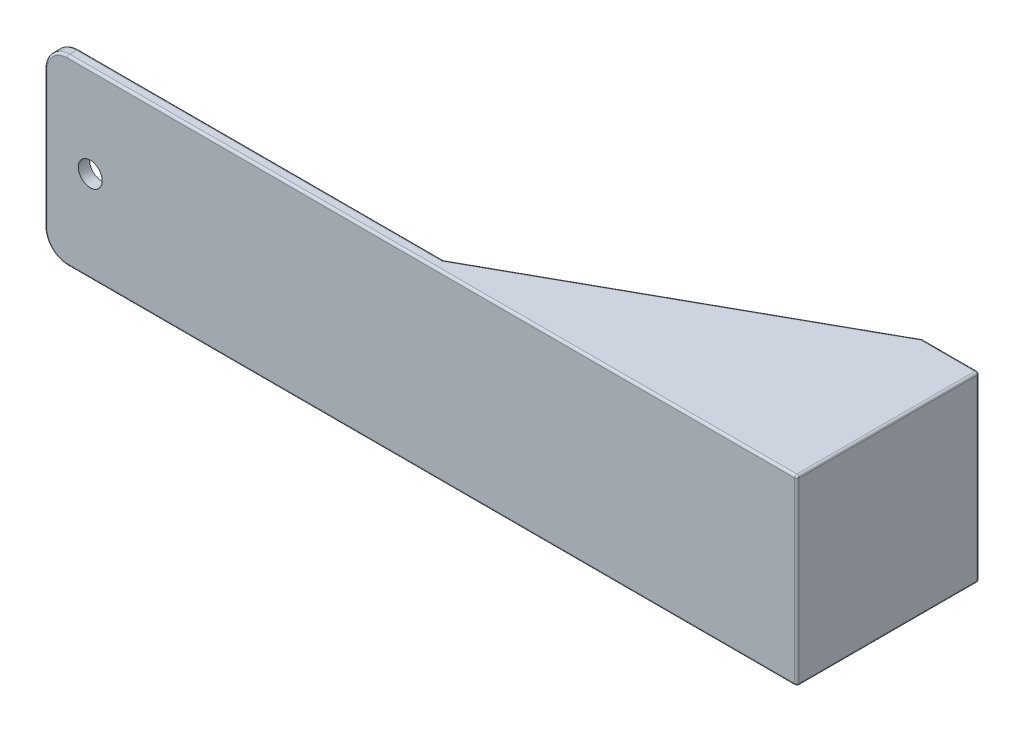
ISO-10303-21;
HEADER;
FILE_DESCRIPTION(('STEP AP214'),'2;1');
FILE_NAME('part.step','',(''),(''),'','','');
FILE_SCHEMA(('AUTOMOTIVE_DESIGN { 1 0 10303 214 1 1 1 1 }'));
ENDSEC;
DATA;
#1=APPLICATION_CONTEXT('core data for automotive mechanical design processes');
#2=APPLICATION_PROTOCOL_DEFINITION('international standard','automotive_design',2000,#1);
#3=PRODUCT_CONTEXT('',#1,'mechanical');
#4=PRODUCT('Part','Part','',(#3));
#5=PRODUCT_RELATED_PRODUCT_CATEGORY('part','',(#4));
#6=PRODUCT_DEFINITION_FORMATION('','',#4);
#7=PRODUCT_DEFINITION_CONTEXT('part definition',#1,'design');
#8=PRODUCT_DEFINITION('design','',#6,#7);
#9=PRODUCT_DEFINITION_SHAPE('','',#8);
#10=(LENGTH_UNIT() NAMED_UNIT(*) SI_UNIT(.MILLI.,.METRE.));
#11=(NAMED_UNIT(*) PLANE_ANGLE_UNIT() SI_UNIT($,.RADIAN.));
#12=(NAMED_UNIT(*) SI_UNIT($,.STERADIAN.) SOLID_ANGLE_UNIT());
#13=UNCERTAINTY_MEASURE_WITH_UNIT(LENGTH_MEASURE(1.E-05),#10,'distance_accuracy_value','');
#14=(GEOMETRIC_REPRESENTATION_CONTEXT(3) GLOBAL_UNCERTAINTY_ASSIGNED_CONTEXT((#13)) GLOBAL_UNIT_ASSIGNED_CONTEXT((#10,
#11,#12)) REPRESENTATION_CONTEXT('',''));
#15=CARTESIAN_POINT('',(0.,0.,0.));
#16=DIRECTION('',(0.,0.,1.));
#17=DIRECTION('',(1.,0.,0.));
#18=AXIS2_PLACEMENT_3D('',#15,#16,#17);
#19=CARTESIAN_POINT('',(160.,115.166481891865,0.));
#20=DIRECTION('',(-1.,0.,0.));
#21=DIRECTION('',(0.,-1.,0.));
#22=AXIS2_PLACEMENT_3D('',#19,#20,#21);
#23=PLANE('',#22);
#24=DIRECTION('',(0.,-1.,0.));
#25=VECTOR('',#24,1.);
#26=CARTESIAN_POINT('',(160.,115.166481891865,0.));
#27=LINE('',#26,#25);
#28=CARTESIAN_POINT('',(160.,35.,0.));
#29=VERTEX_POINT('',#28);
#30=CARTESIAN_POINT('',(160.,-35.,0.));
#31=VERTEX_POINT('',#30);
#32=EDGE_CURVE('E285',#29,#31,#27,.T.);
#33=ORIENTED_EDGE('',*,*,#32,.F.);
#34=DIRECTION('',(0.,0.,-1.));
#35=VECTOR('',#34,1.);
#36=CARTESIAN_POINT('',(160.,35.,0.));
#37=LINE('',#36,#35);
#38=CARTESIAN_POINT('',(160.,35.,-70.));
#39=VERTEX_POINT('',#38);
#40=EDGE_CURVE('E258',#29,#39,#37,.T.);
#41=ORIENTED_EDGE('',*,*,#40,.T.);
#42=DIRECTION('',(0.,-1.,0.));
#43=VECTOR('',#42,1.);
#44=CARTESIAN_POINT('',(160.,60.6155281280883,-70.));
#45=LINE('',#44,#43);
#46=CARTESIAN_POINT('',(160.,-35.,-70.));
#47=VERTEX_POINT('',#46);
#48=EDGE_CURVE('E282',#39,#47,#45,.T.);
#49=ORIENTED_EDGE('',*,*,#48,.T.);
#50=DIRECTION('',(0.,0.,1.));
#51=VECTOR('',#50,1.);
#52=CARTESIAN_POINT('',(160.,-35.,0.));
#53=LINE('',#52,#51);
#54=EDGE_CURVE('E276',#47,#31,#53,.T.);
#55=ORIENTED_EDGE('',*,*,#54,.T.);
#56=EDGE_LOOP('',(#33,#41,#49,#55));
#57=FACE_BOUND('',#56,.T.);
#58=ADVANCED_FACE('F36',(#57),#23,.T.);
#59=CARTESIAN_POINT('',(140.,60.6155281280883,-75.));
#60=DIRECTION('',(-1.,0.,0.));
#61=DIRECTION('',(0.,-1.,0.));
#62=AXIS2_PLACEMENT_3D('',#59,#60,#61);
#63=PLANE('',#62);
#64=DIRECTION('',(0.,-1.,0.));
#65=VECTOR('',#64,1.);
#66=CARTESIAN_POINT('',(140.,60.6155281280883,-70.));
#67=LINE('',#66,#65);
#68=CARTESIAN_POINT('',(140.,35.,-70.));
#69=VERTEX_POINT('',#68);
#70=CARTESIAN_POINT('',(140.,-35.,-70.));
#71=VERTEX_POINT('',#70);
#72=EDGE_CURVE('E286',#69,#71,#67,.T.);
#73=ORIENTED_EDGE('',*,*,#72,.F.);
#74=DIRECTION('',(0.,0.,-1.));
#75=VECTOR('',#74,1.);
#76=CARTESIAN_POINT('',(140.,35.,-75.));
#77=LINE('',#76,#75);
#78=CARTESIAN_POINT('',(140.,35.,-73.8560410954459));
#79=VERTEX_POINT('',#78);
#80=EDGE_CURVE('E264',#69,#79,#77,.T.);
#81=ORIENTED_EDGE('',*,*,#80,.T.);
#82=CARTESIAN_POINT('',(140.,36.,-73.8560410954459));
#83=DIRECTION('',(-1.,0.,0.));
#84=DIRECTION('',(0.,0.,-1.));
#85=AXIS2_PLACEMENT_3D('',#82,#83,#84);
#86=ELLIPSE('',#85,1.14395890455411,1.);
#87=CARTESIAN_POINT('',(140.,36.,-75.));
#88=VERTEX_POINT('',#87);
#89=EDGE_CURVE('E45',#79,#88,#86,.F.);
#90=ORIENTED_EDGE('',*,*,#89,.T.);
#91=DIRECTION('',(0.,-1.,0.));
#92=VECTOR('',#91,1.);
#93=CARTESIAN_POINT('',(140.,60.6155281280883,-75.));
#94=LINE('',#93,#92);
#95=CARTESIAN_POINT('',(140.,-35.9999999999999,-75.));
#96=VERTEX_POINT('',#95);
#97=EDGE_CURVE('E53',#88,#96,#94,.T.);
#98=ORIENTED_EDGE('',*,*,#97,.T.);
#99=CARTESIAN_POINT('',(140.,-36.,-73.8560410954459));
#100=DIRECTION('',(-1.,0.,0.));
#101=DIRECTION('',(0.,0.,1.));
#102=AXIS2_PLACEMENT_3D('',#99,#100,#101);
#103=ELLIPSE('',#102,1.14395890455411,1.);
#104=CARTESIAN_POINT('',(140.,-35.,-73.8560410954459));
#105=VERTEX_POINT('',#104);
#106=EDGE_CURVE('E171',#96,#105,#103,.F.);
#107=ORIENTED_EDGE('',*,*,#106,.T.);
#108=DIRECTION('',(0.,0.,1.));
#109=VECTOR('',#108,1.);
#110=CARTESIAN_POINT('',(140.,-35.,-75.));
#111=LINE('',#110,#109);
#112=EDGE_CURVE('E271',#105,#71,#111,.T.);
#113=ORIENTED_EDGE('',*,*,#112,.T.);
#114=EDGE_LOOP('',(#73,#81,#90,#98,#107,#113));
#115=FACE_BOUND('',#114,.T.);
#116=ADVANCED_FACE('F504',(#115),#63,.T.);
#117=CARTESIAN_POINT('',(160.,60.6155281280883,-70.));
#118=DIRECTION('',(0.,0.,1.));
#119=DIRECTION('',(1.,0.,0.));
#120=AXIS2_PLACEMENT_3D('',#117,#118,#119);
#121=PLANE('',#120);
#122=CARTESIAN_POINT('',(152.,-15.,-70.));
#123=DIRECTION('',(0.,0.,-1.));
#124=DIRECTION('',(-1.,0.,0.));
#125=AXIS2_PLACEMENT_3D('',#122,#123,#124);
#126=CIRCLE('',#125,2.99999999999999);
#127=CARTESIAN_POINT('',(149.,-15.,-70.));
#128=VERTEX_POINT('',#127);
#129=EDGE_CURVE('E255',#128,#128,#126,.T.);
#130=ORIENTED_EDGE('',*,*,#129,.T.);
#131=EDGE_LOOP('',(#130));
#132=FACE_BOUND('',#131,.T.);
#133=CARTESIAN_POINT('',(152.,15.,-70.));
#134=DIRECTION('',(0.,0.,-1.));
#135=DIRECTION('',(-1.,0.,0.));
#136=AXIS2_PLACEMENT_3D('',#133,#134,#135);
#137=CIRCLE('',#136,2.99999999999999);
#138=CARTESIAN_POINT('',(149.,15.,-70.));
#139=VERTEX_POINT('',#138);
#140=EDGE_CURVE('E243',#139,#139,#137,.T.);
#141=ORIENTED_EDGE('',*,*,#140,.T.);
#142=EDGE_LOOP('',(#141));
#143=FACE_BOUND('',#142,.T.);
#144=ORIENTED_EDGE('',*,*,#48,.F.);
#145=DIRECTION('',(-1.,0.,0.));
#146=VECTOR('',#145,1.);
#147=CARTESIAN_POINT('',(160.,35.,-70.));
#148=LINE('',#147,#146);
#149=EDGE_CURVE('E261',#39,#69,#148,.T.);
#150=ORIENTED_EDGE('',*,*,#149,.T.);
#151=ORIENTED_EDGE('',*,*,#72,.T.);
#152=DIRECTION('',(1.,0.,0.));
#153=VECTOR('',#152,1.);
#154=CARTESIAN_POINT('',(160.,-35.,-70.));
#155=LINE('',#154,#153);
#156=EDGE_CURVE('E310',#71,#47,#155,.T.);
#157=ORIENTED_EDGE('',*,*,#156,.T.);
#158=EDGE_LOOP('',(#144,#150,#151,#157));
#159=FACE_BOUND('',#158,.T.);
#160=ADVANCED_FACE('F527',(#132,#143,#159),#121,.T.);
#161=CARTESIAN_POINT('',(0.,0.,0.));
#162=DIRECTION('',(0.,0.,1.));
#163=DIRECTION('',(1.,0.,0.));
#164=AXIS2_PLACEMENT_3D('',#161,#162,#163);
#165=PLANE('',#164);
#166=CARTESIAN_POINT('',(-145.,0.,0.));
#167=DIRECTION('',(0.,0.,1.));
#168=DIRECTION('',(1.,0.,0.));
#169=AXIS2_PLACEMENT_3D('',#166,#167,#168);
#170=CIRCLE('',#169,5.25);
#171=CARTESIAN_POINT('',(-139.75,0.,0.));
#172=VERTEX_POINT('',#171);
#173=EDGE_CURVE('E294',#172,#172,#170,.T.);
#174=ORIENTED_EDGE('',*,*,#173,.T.);
#175=EDGE_LOOP('',(#174));
#176=FACE_BOUND('',#175,.T.);
#177=CARTESIAN_POINT('',(-155.,30.,0.));
#178=DIRECTION('',(0.,0.,1.));
#179=DIRECTION('',(1.,0.,0.));
#180=AXIS2_PLACEMENT_3D('',#177,#178,#179);
#181=CIRCLE('',#180,9.);
#182=CARTESIAN_POINT('',(-164.,30.,0.));
#183=VERTEX_POINT('',#182);
#184=CARTESIAN_POINT('',(-155.,39.,0.));
#185=VERTEX_POINT('',#184);
#186=EDGE_CURVE('E358',#183,#185,#181,.F.);
#187=ORIENTED_EDGE('',*,*,#186,.T.);
#188=DIRECTION('',(-1.,0.,0.));
#189=VECTOR('',#188,1.);
#190=CARTESIAN_POINT('',(0.,39.,0.));
#191=LINE('',#190,#189);
#192=CARTESIAN_POINT('',(5.00000000000007,39.,0.));
#193=VERTEX_POINT('',#192);
#194=EDGE_CURVE('E361',#185,#193,#191,.F.);
#195=ORIENTED_EDGE('',*,*,#194,.T.);
#196=DIRECTION('',(0.,1.,0.));
#197=VECTOR('',#196,1.);
#198=CARTESIAN_POINT('',(5.00000000000006,35.,0.));
#199=LINE('',#198,#197);
#200=CARTESIAN_POINT('',(5.00000000000006,36.,0.));
#201=VERTEX_POINT('',#200);
#202=EDGE_CURVE('E252',#201,#193,#199,.T.);
#203=ORIENTED_EDGE('',*,*,#202,.F.);
#204=CARTESIAN_POINT('',(7.05912602819747,36.,0.));
#205=DIRECTION('',(0.,0.,1.));
#206=DIRECTION('',(1.,0.,0.));
#207=AXIS2_PLACEMENT_3D('',#204,#205,#206);
#208=ELLIPSE('',#207,2.0591260281974,1.);
#209=CARTESIAN_POINT('',(7.05912602819746,35.,0.));
#210=VERTEX_POINT('',#209);
#211=EDGE_CURVE('E11',#201,#210,#208,.T.);
#212=ORIENTED_EDGE('',*,*,#211,.T.);
#213=DIRECTION('',(-1.,0.,0.));
#214=VECTOR('',#213,1.);
#215=CARTESIAN_POINT('',(0.,35.,0.));
#216=LINE('',#215,#214);
#217=EDGE_CURVE('E254',#29,#210,#216,.T.);
#218=ORIENTED_EDGE('',*,*,#217,.F.);
#219=ORIENTED_EDGE('',*,*,#32,.T.);
#220=DIRECTION('',(1.,0.,0.));
#221=VECTOR('',#220,1.);
#222=CARTESIAN_POINT('',(0.,-35.,0.));
#223=LINE('',#222,#221);
#224=CARTESIAN_POINT('',(7.05912602819746,-35.,0.));
#225=VERTEX_POINT('',#224);
#226=EDGE_CURVE('E279',#225,#31,#223,.T.);
#227=ORIENTED_EDGE('',*,*,#226,.F.);
#228=CARTESIAN_POINT('',(7.05912602819747,-36.,0.));
#229=DIRECTION('',(0.,0.,1.));
#230=DIRECTION('',(-1.,0.,0.));
#231=AXIS2_PLACEMENT_3D('',#228,#229,#230);
#232=ELLIPSE('',#231,2.0591260281974,1.);
#233=CARTESIAN_POINT('',(5.00000000000006,-36.,0.));
#234=VERTEX_POINT('',#233);
#235=EDGE_CURVE('E173',#225,#234,#232,.T.);
#236=ORIENTED_EDGE('',*,*,#235,.T.);
#237=DIRECTION('',(0.,-1.,0.));
#238=VECTOR('',#237,1.);
#239=CARTESIAN_POINT('',(5.00000000000006,-35.,0.));
#240=LINE('',#239,#238);
#241=CARTESIAN_POINT('',(5.00000000000007,-39.,0.));
#242=VERTEX_POINT('',#241);
#243=EDGE_CURVE('E267',#234,#242,#240,.T.);
#244=ORIENTED_EDGE('',*,*,#243,.T.);
#245=DIRECTION('',(1.,0.,0.));
#246=VECTOR('',#245,1.);
#247=CARTESIAN_POINT('',(0.,-39.,0.));
#248=LINE('',#247,#246);
#249=CARTESIAN_POINT('',(-155.,-39.,0.));
#250=VERTEX_POINT('',#249);
#251=EDGE_CURVE('E349',#242,#250,#248,.F.);
#252=ORIENTED_EDGE('',*,*,#251,.T.);
#253=CARTESIAN_POINT('',(-155.,-30.,0.));
#254=DIRECTION('',(0.,0.,1.));
#255=DIRECTION('',(1.,0.,0.));
#256=AXIS2_PLACEMENT_3D('',#253,#254,#255);
#257=CIRCLE('',#256,9.);
#258=CARTESIAN_POINT('',(-164.,-30.,0.));
#259=VERTEX_POINT('',#258);
#260=EDGE_CURVE('E352',#250,#259,#257,.F.);
#261=ORIENTED_EDGE('',*,*,#260,.T.);
#262=DIRECTION('',(0.,-1.,0.));
#263=VECTOR('',#262,1.);
#264=CARTESIAN_POINT('',(-164.,0.,0.));
#265=LINE('',#264,#263);
#266=EDGE_CURVE('E355',#259,#183,#265,.F.);
#267=ORIENTED_EDGE('',*,*,#266,.T.);
#268=EDGE_LOOP('',(#187,#195,#203,#212,#218,#219,#227,#236,#244,#252,#261,#267));
#269=FACE_BOUND('',#268,.T.);
#270=ADVANCED_FACE('F509',(#176,#269),#165,.F.);
#271=CARTESIAN_POINT('',(-165.,-40.,5.));
#272=DIRECTION('',(1.,0.,0.));
#273=DIRECTION('',(0.,0.,-1.));
#274=AXIS2_PLACEMENT_3D('',#271,#272,#273);
#275=PLANE('',#274);
#276=DIRECTION('',(0.,0.,-1.));
#277=VECTOR('',#276,1.);
#278=CARTESIAN_POINT('',(-165.,-30.,5.));
#279=LINE('',#278,#277);
#280=CARTESIAN_POINT('',(-165.,-30.,1.));
#281=VERTEX_POINT('',#280);
#282=CARTESIAN_POINT('',(-165.,-30.,4.));
#283=VERTEX_POINT('',#282);
#284=EDGE_CURVE('E304',#281,#283,#279,.F.);
#285=ORIENTED_EDGE('',*,*,#284,.T.);
#286=DIRECTION('',(0.,-1.,0.));
#287=VECTOR('',#286,1.);
#288=CARTESIAN_POINT('',(-165.,30.,4.));
#289=LINE('',#288,#287);
#290=CARTESIAN_POINT('',(-165.,30.,4.));
#291=VERTEX_POINT('',#290);
#292=EDGE_CURVE('E340',#283,#291,#289,.F.);
#293=ORIENTED_EDGE('',*,*,#292,.T.);
#294=DIRECTION('',(0.,0.,-1.));
#295=VECTOR('',#294,1.);
#296=CARTESIAN_POINT('',(-165.,30.,5.));
#297=LINE('',#296,#295);
#298=CARTESIAN_POINT('',(-165.,30.,1.));
#299=VERTEX_POINT('',#298);
#300=EDGE_CURVE('E301',#291,#299,#297,.T.);
#301=ORIENTED_EDGE('',*,*,#300,.T.);
#302=DIRECTION('',(0.,-1.,0.));
#303=VECTOR('',#302,1.);
#304=CARTESIAN_POINT('',(-165.,-40.,1.));
#305=LINE('',#304,#303);
#306=EDGE_CURVE('E337',#299,#281,#305,.T.);
#307=ORIENTED_EDGE('',*,*,#306,.T.);
#308=EDGE_LOOP('',(#285,#293,#301,#307));
#309=FACE_BOUND('',#308,.T.);
#310=ADVANCED_FACE('F549',(#309),#275,.F.);
#311=CARTESIAN_POINT('',(165.,-40.,5.));
#312=DIRECTION('',(0.,1.,0.));
#313=DIRECTION('',(-1.,0.,0.));
#314=AXIS2_PLACEMENT_3D('',#311,#312,#313);
#315=PLANE('',#314);
#316=DIRECTION('',(0.,0.,-1.));
#317=VECTOR('',#316,1.);
#318=CARTESIAN_POINT('',(164.,-40.,5.));
#319=LINE('',#318,#317);
#320=CARTESIAN_POINT('',(164.,-40.,-74.));
#321=VERTEX_POINT('',#320);
#322=CARTESIAN_POINT('',(164.,-40.,4.));
#323=VERTEX_POINT('',#322);
#324=EDGE_CURVE('E116',#321,#323,#319,.F.);
#325=ORIENTED_EDGE('',*,*,#324,.T.);
#326=DIRECTION('',(1.,0.,0.));
#327=VECTOR('',#326,1.);
#328=CARTESIAN_POINT('',(-155.,-40.,4.));
#329=LINE('',#328,#327);
#330=CARTESIAN_POINT('',(-155.,-40.,4.));
#331=VERTEX_POINT('',#330);
#332=EDGE_CURVE('E122',#323,#331,#329,.F.);
#333=ORIENTED_EDGE('',*,*,#332,.T.);
#334=DIRECTION('',(0.,0.,-1.));
#335=VECTOR('',#334,1.);
#336=CARTESIAN_POINT('',(-155.,-40.,5.));
#337=LINE('',#336,#335);
#338=CARTESIAN_POINT('',(-155.,-40.,1.));
#339=VERTEX_POINT('',#338);
#340=EDGE_CURVE('E297',#331,#339,#337,.T.);
#341=ORIENTED_EDGE('',*,*,#340,.T.);
#342=DIRECTION('',(1.,0.,0.));
#343=VECTOR('',#342,1.);
#344=CARTESIAN_POINT('',(165.,-40.,1.));
#345=LINE('',#344,#343);
#346=CARTESIAN_POINT('',(5.25912602819747,-40.,1.));
#347=VERTEX_POINT('',#346);
#348=EDGE_CURVE('E396',#339,#347,#345,.T.);
#349=ORIENTED_EDGE('',*,*,#348,.T.);
#350=DIRECTION('',(0.874157276121538,0.,-0.485642931178632));
#351=VECTOR('',#350,1.);
#352=CARTESIAN_POINT('',(140.485642931179,-40.,-74.1258427238784));
#353=LINE('',#352,#351);
#354=CARTESIAN_POINT('',(140.259126028197,-40.,-74.));
#355=VERTEX_POINT('',#354);
#356=EDGE_CURVE('E398',#347,#355,#353,.T.);
#357=ORIENTED_EDGE('',*,*,#356,.T.);
#358=DIRECTION('',(1.,0.,0.));
#359=VECTOR('',#358,1.);
#360=CARTESIAN_POINT('',(165.,-40.,-74.));
#361=LINE('',#360,#359);
#362=EDGE_CURVE('E125',#355,#321,#361,.T.);
#363=ORIENTED_EDGE('',*,*,#362,.T.);
#364=EDGE_LOOP('',(#325,#333,#341,#349,#357,#363));
#365=FACE_BOUND('',#364,.T.);
#366=ADVANCED_FACE('F118',(#365),#315,.F.);
#367=CARTESIAN_POINT('',(165.,-40.,5.));
#368=DIRECTION('',(-1.,0.,0.));
#369=DIRECTION('',(0.,0.,1.));
#370=AXIS2_PLACEMENT_3D('',#367,#368,#369);
#371=PLANE('',#370);
#372=DIRECTION('',(0.,-1.,0.));
#373=VECTOR('',#372,1.);
#374=CARTESIAN_POINT('',(165.,40.,-74.));
#375=LINE('',#374,#373);
#376=CARTESIAN_POINT('',(165.,-39.,-74.));
#377=VERTEX_POINT('',#376);
#378=CARTESIAN_POINT('',(165.,39.,-74.));
#379=VERTEX_POINT('',#378);
#380=EDGE_CURVE('E391',#377,#379,#375,.F.);
#381=ORIENTED_EDGE('',*,*,#380,.T.);
#382=DIRECTION('',(0.,0.,-1.));
#383=VECTOR('',#382,1.);
#384=CARTESIAN_POINT('',(165.,39.,5.));
#385=LINE('',#384,#383);
#386=CARTESIAN_POINT('',(165.,39.,4.));
#387=VERTEX_POINT('',#386);
#388=EDGE_CURVE('E394',#379,#387,#385,.F.);
#389=ORIENTED_EDGE('',*,*,#388,.T.);
#390=DIRECTION('',(0.,1.,0.));
#391=VECTOR('',#390,1.);
#392=CARTESIAN_POINT('',(165.,-40.,4.));
#393=LINE('',#392,#391);
#394=CARTESIAN_POINT('',(165.,-39.,4.));
#395=VERTEX_POINT('',#394);
#396=EDGE_CURVE('E389',#387,#395,#393,.F.);
#397=ORIENTED_EDGE('',*,*,#396,.T.);
#398=DIRECTION('',(0.,0.,-1.));
#399=VECTOR('',#398,1.);
#400=CARTESIAN_POINT('',(165.,-39.,5.));
#401=LINE('',#400,#399);
#402=EDGE_CURVE('E135',#395,#377,#401,.T.);
#403=ORIENTED_EDGE('',*,*,#402,.T.);
#404=EDGE_LOOP('',(#381,#389,#397,#403));
#405=FACE_BOUND('',#404,.T.);
#406=ADVANCED_FACE('F418',(#405),#371,.F.);
#407=CARTESIAN_POINT('',(165.,40.,5.));
#408=DIRECTION('',(0.,-1.,0.));
#409=DIRECTION('',(1.,0.,0.));
#410=AXIS2_PLACEMENT_3D('',#407,#408,#409);
#411=PLANE('',#410);
#412=DIRECTION('',(0.,0.,-1.));
#413=VECTOR('',#412,1.);
#414=CARTESIAN_POINT('',(-155.,40.,5.));
#415=LINE('',#414,#413);
#416=CARTESIAN_POINT('',(-155.,40.,1.));
#417=VERTEX_POINT('',#416);
#418=CARTESIAN_POINT('',(-155.,40.,4.));
#419=VERTEX_POINT('',#418);
#420=EDGE_CURVE('E307',#417,#419,#415,.F.);
#421=ORIENTED_EDGE('',*,*,#420,.T.);
#422=DIRECTION('',(-1.,0.,0.));
#423=VECTOR('',#422,1.);
#424=CARTESIAN_POINT('',(165.,40.,4.));
#425=LINE('',#424,#423);
#426=CARTESIAN_POINT('',(164.,40.,4.));
#427=VERTEX_POINT('',#426);
#428=EDGE_CURVE('E375',#419,#427,#425,.F.);
#429=ORIENTED_EDGE('',*,*,#428,.T.);
#430=DIRECTION('',(0.,0.,-1.));
#431=VECTOR('',#430,1.);
#432=CARTESIAN_POINT('',(164.,40.,5.));
#433=LINE('',#432,#431);
#434=CARTESIAN_POINT('',(164.,40.,-74.));
#435=VERTEX_POINT('',#434);
#436=EDGE_CURVE('E364',#427,#435,#433,.T.);
#437=ORIENTED_EDGE('',*,*,#436,.T.);
#438=DIRECTION('',(-1.,0.,0.));
#439=VECTOR('',#438,1.);
#440=CARTESIAN_POINT('',(140.,40.,-74.));
#441=LINE('',#440,#439);
#442=CARTESIAN_POINT('',(140.259126028197,40.,-74.));
#443=VERTEX_POINT('',#442);
#444=EDGE_CURVE('E367',#435,#443,#441,.T.);
#445=ORIENTED_EDGE('',*,*,#444,.T.);
#446=DIRECTION('',(0.874157276121538,0.,-0.485642931178632));
#447=VECTOR('',#446,1.);
#448=CARTESIAN_POINT('',(125.627152365141,40.,-65.8711257427464));
#449=LINE('',#448,#447);
#450=CARTESIAN_POINT('',(5.25912602819747,40.,1.));
#451=VERTEX_POINT('',#450);
#452=EDGE_CURVE('E370',#443,#451,#449,.F.);
#453=ORIENTED_EDGE('',*,*,#452,.T.);
#454=DIRECTION('',(-1.,0.,0.));
#455=VECTOR('',#454,1.);
#456=CARTESIAN_POINT('',(165.,40.,1.));
#457=LINE('',#456,#455);
#458=EDGE_CURVE('E372',#451,#417,#457,.T.);
#459=ORIENTED_EDGE('',*,*,#458,.T.);
#460=EDGE_LOOP('',(#421,#429,#437,#445,#453,#459));
#461=FACE_BOUND('',#460,.T.);
#462=ADVANCED_FACE('F490',(#461),#411,.F.);
#463=CARTESIAN_POINT('',(0.,0.,5.));
#464=DIRECTION('',(0.,0.,1.));
#465=DIRECTION('',(1.,0.,0.));
#466=AXIS2_PLACEMENT_3D('',#463,#464,#465);
#467=PLANE('',#466);
#468=DIRECTION('',(-1.,0.,0.));
#469=VECTOR('',#468,1.);
#470=CARTESIAN_POINT('',(-155.,39.,5.));
#471=LINE('',#470,#469);
#472=CARTESIAN_POINT('',(164.,39.,5.));
#473=VERTEX_POINT('',#472);
#474=CARTESIAN_POINT('',(-155.,39.,5.));
#475=VERTEX_POINT('',#474);
#476=EDGE_CURVE('E319',#473,#475,#471,.T.);
#477=ORIENTED_EDGE('',*,*,#476,.T.);
#478=CARTESIAN_POINT('',(-155.,30.,5.));
#479=DIRECTION('',(0.,0.,1.));
#480=DIRECTION('',(1.,0.,0.));
#481=AXIS2_PLACEMENT_3D('',#478,#479,#480);
#482=CIRCLE('',#481,9.);
#483=CARTESIAN_POINT('',(-164.,30.,5.));
#484=VERTEX_POINT('',#483);
#485=EDGE_CURVE('E328',#475,#484,#482,.T.);
#486=ORIENTED_EDGE('',*,*,#485,.T.);
#487=DIRECTION('',(0.,-1.,0.));
#488=VECTOR('',#487,1.);
#489=CARTESIAN_POINT('',(-164.,-30.,5.));
#490=LINE('',#489,#488);
#491=CARTESIAN_POINT('',(-164.,-30.,5.));
#492=VERTEX_POINT('',#491);
#493=EDGE_CURVE('E325',#484,#492,#490,.T.);
#494=ORIENTED_EDGE('',*,*,#493,.T.);
#495=CARTESIAN_POINT('',(-155.,-30.,5.));
#496=DIRECTION('',(0.,0.,1.));
#497=DIRECTION('',(1.,0.,0.));
#498=AXIS2_PLACEMENT_3D('',#495,#496,#497);
#499=CIRCLE('',#498,9.);
#500=CARTESIAN_POINT('',(-155.,-39.,5.));
#501=VERTEX_POINT('',#500);
#502=EDGE_CURVE('E322',#492,#501,#499,.T.);
#503=ORIENTED_EDGE('',*,*,#502,.T.);
#504=DIRECTION('',(1.,0.,0.));
#505=VECTOR('',#504,1.);
#506=CARTESIAN_POINT('',(165.,-39.,5.));
#507=LINE('',#506,#505);
#508=CARTESIAN_POINT('',(164.,-39.,5.));
#509=VERTEX_POINT('',#508);
#510=EDGE_CURVE('E313',#501,#509,#507,.T.);
#511=ORIENTED_EDGE('',*,*,#510,.T.);
#512=DIRECTION('',(0.,1.,0.));
#513=VECTOR('',#512,1.);
#514=CARTESIAN_POINT('',(164.,40.,5.));
#515=LINE('',#514,#513);
#516=EDGE_CURVE('E316',#509,#473,#515,.T.);
#517=ORIENTED_EDGE('',*,*,#516,.T.);
#518=EDGE_LOOP('',(#477,#486,#494,#503,#511,#517));
#519=FACE_BOUND('',#518,.T.);
#520=CARTESIAN_POINT('',(-145.,0.,5.));
#521=DIRECTION('',(0.,0.,1.));
#522=DIRECTION('',(1.,0.,0.));
#523=AXIS2_PLACEMENT_3D('',#520,#521,#522);
#524=CIRCLE('',#523,5.25);
#525=CARTESIAN_POINT('',(-139.75,0.,5.));
#526=VERTEX_POINT('',#525);
#527=EDGE_CURVE('E293',#526,#526,#524,.T.);
#528=ORIENTED_EDGE('',*,*,#527,.F.);
#529=EDGE_LOOP('',(#528));
#530=FACE_BOUND('',#529,.T.);
#531=ADVANCED_FACE('F442',(#519,#530),#467,.T.);
#532=CARTESIAN_POINT('',(-145.,0.,0.));
#533=DIRECTION('',(0.,0.,1.));
#534=DIRECTION('',(1.,0.,0.));
#535=AXIS2_PLACEMENT_3D('',#532,#533,#534);
#536=CYLINDRICAL_SURFACE('',#535,5.25);
#537=ORIENTED_EDGE('',*,*,#173,.F.);
#538=EDGE_LOOP('',(#537));
#539=FACE_BOUND('',#538,.T.);
#540=ORIENTED_EDGE('',*,*,#527,.T.);
#541=EDGE_LOOP('',(#540));
#542=FACE_BOUND('',#541,.T.);
#543=ADVANCED_FACE('F579',(#539,#542),#536,.F.);
#544=CARTESIAN_POINT('',(-155.,-30.,5.));
#545=DIRECTION('',(0.,0.,-1.));
#546=DIRECTION('',(-1.,0.,0.));
#547=AXIS2_PLACEMENT_3D('',#544,#545,#546);
#548=CYLINDRICAL_SURFACE('',#547,10.);
#549=ORIENTED_EDGE('',*,*,#340,.F.);
#550=CARTESIAN_POINT('',(-155.,-30.,4.));
#551=DIRECTION('',(0.,0.,1.));
#552=DIRECTION('',(1.,0.,0.));
#553=AXIS2_PLACEMENT_3D('',#550,#551,#552);
#554=CIRCLE('',#553,10.);
#555=EDGE_CURVE('E346',#331,#283,#554,.F.);
#556=ORIENTED_EDGE('',*,*,#555,.T.);
#557=ORIENTED_EDGE('',*,*,#284,.F.);
#558=CARTESIAN_POINT('',(-155.,-30.,1.));
#559=DIRECTION('',(0.,0.,1.));
#560=DIRECTION('',(1.,0.,0.));
#561=AXIS2_PLACEMENT_3D('',#558,#559,#560);
#562=CIRCLE('',#561,10.);
#563=EDGE_CURVE('E343',#281,#339,#562,.T.);
#564=ORIENTED_EDGE('',*,*,#563,.T.);
#565=EDGE_LOOP('',(#549,#556,#557,#564));
#566=FACE_BOUND('',#565,.T.);
#567=ADVANCED_FACE('F546',(#566),#548,.T.);
#568=CARTESIAN_POINT('',(-155.,30.,5.));
#569=DIRECTION('',(0.,0.,-1.));
#570=DIRECTION('',(-1.,0.,0.));
#571=AXIS2_PLACEMENT_3D('',#568,#569,#570);
#572=CYLINDRICAL_SURFACE('',#571,10.);
#573=ORIENTED_EDGE('',*,*,#300,.F.);
#574=CARTESIAN_POINT('',(-155.,30.,4.));
#575=DIRECTION('',(0.,0.,1.));
#576=DIRECTION('',(1.,0.,0.));
#577=AXIS2_PLACEMENT_3D('',#574,#575,#576);
#578=CIRCLE('',#577,10.);
#579=EDGE_CURVE('E334',#291,#419,#578,.F.);
#580=ORIENTED_EDGE('',*,*,#579,.T.);
#581=ORIENTED_EDGE('',*,*,#420,.F.);
#582=CARTESIAN_POINT('',(-155.,30.,1.));
#583=DIRECTION('',(0.,0.,1.));
#584=DIRECTION('',(1.,0.,0.));
#585=AXIS2_PLACEMENT_3D('',#582,#583,#584);
#586=CIRCLE('',#585,10.);
#587=EDGE_CURVE('E331',#417,#299,#586,.T.);
#588=ORIENTED_EDGE('',*,*,#587,.T.);
#589=EDGE_LOOP('',(#573,#580,#581,#588));
#590=FACE_BOUND('',#589,.T.);
#591=ADVANCED_FACE('F598',(#590),#572,.T.);
#592=CARTESIAN_POINT('',(165.,115.166481891865,-75.));
#593=DIRECTION('',(0.,0.,-1.));
#594=DIRECTION('',(-1.,0.,0.));
#595=AXIS2_PLACEMENT_3D('',#592,#593,#594);
#596=PLANE('',#595);
#597=CARTESIAN_POINT('',(152.,-15.,-75.));
#598=DIRECTION('',(0.,0.,-1.));
#599=DIRECTION('',(-1.,0.,0.));
#600=AXIS2_PLACEMENT_3D('',#597,#598,#599);
#601=CIRCLE('',#600,2.99999999999999);
#602=CARTESIAN_POINT('',(149.,-15.,-75.));
#603=VERTEX_POINT('',#602);
#604=EDGE_CURVE('E248',#603,#603,#601,.T.);
#605=ORIENTED_EDGE('',*,*,#604,.F.);
#606=EDGE_LOOP('',(#605));
#607=FACE_BOUND('',#606,.T.);
#608=CARTESIAN_POINT('',(152.,15.,-75.));
#609=DIRECTION('',(0.,0.,-1.));
#610=DIRECTION('',(-1.,0.,0.));
#611=AXIS2_PLACEMENT_3D('',#608,#609,#610);
#612=CIRCLE('',#611,2.99999999999999);
#613=CARTESIAN_POINT('',(149.,15.,-75.));
#614=VERTEX_POINT('',#613);
#615=EDGE_CURVE('E236',#614,#614,#612,.T.);
#616=ORIENTED_EDGE('',*,*,#615,.F.);
#617=EDGE_LOOP('',(#616));
#618=FACE_BOUND('',#617,.T.);
#619=CARTESIAN_POINT('',(140.,39.,-75.));
#620=VERTEX_POINT('',#619);
#621=EDGE_CURVE('E283',#620,#88,#94,.T.);
#622=ORIENTED_EDGE('',*,*,#621,.F.);
#623=DIRECTION('',(-1.,0.,0.));
#624=VECTOR('',#623,1.);
#625=CARTESIAN_POINT('',(165.,39.,-75.));
#626=LINE('',#625,#624);
#627=CARTESIAN_POINT('',(164.,39.,-75.));
#628=VERTEX_POINT('',#627);
#629=EDGE_CURVE('E386',#620,#628,#626,.F.);
#630=ORIENTED_EDGE('',*,*,#629,.T.);
#631=DIRECTION('',(0.,-1.,0.));
#632=VECTOR('',#631,1.);
#633=CARTESIAN_POINT('',(164.,-40.,-75.));
#634=LINE('',#633,#632);
#635=CARTESIAN_POINT('',(164.,-39.,-75.));
#636=VERTEX_POINT('',#635);
#637=EDGE_CURVE('E384',#628,#636,#634,.T.);
#638=ORIENTED_EDGE('',*,*,#637,.T.);
#639=DIRECTION('',(1.,0.,0.));
#640=VECTOR('',#639,1.);
#641=CARTESIAN_POINT('',(140.,-39.,-75.));
#642=LINE('',#641,#640);
#643=CARTESIAN_POINT('',(140.,-39.,-75.));
#644=VERTEX_POINT('',#643);
#645=EDGE_CURVE('E382',#636,#644,#642,.F.);
#646=ORIENTED_EDGE('',*,*,#645,.T.);
#647=DIRECTION('',(0.,-1.,0.));
#648=VECTOR('',#647,1.);
#649=CARTESIAN_POINT('',(140.,-35.,-75.));
#650=LINE('',#649,#648);
#651=EDGE_CURVE('E268',#96,#644,#650,.T.);
#652=ORIENTED_EDGE('',*,*,#651,.F.);
#653=ORIENTED_EDGE('',*,*,#97,.F.);
#654=EDGE_LOOP('',(#622,#630,#638,#646,#652,#653));
#655=FACE_BOUND('',#654,.T.);
#656=ADVANCED_FACE('F500',(#607,#618,#655),#596,.T.);
#657=CARTESIAN_POINT('',(0.,-35.,0.));
#658=DIRECTION('',(0.,-1.,0.));
#659=DIRECTION('',(1.,0.,0.));
#660=AXIS2_PLACEMENT_3D('',#657,#658,#659);
#661=PLANE('',#660);
#662=ORIENTED_EDGE('',*,*,#112,.F.);
#663=DIRECTION('',(0.874157276121538,0.,-0.485642931178632));
#664=VECTOR('',#663,1.);
#665=CARTESIAN_POINT('',(5.4856429311787,-35.,0.874157276121538));
#666=LINE('',#665,#664);
#667=EDGE_CURVE('E166',#105,#225,#666,.F.);
#668=ORIENTED_EDGE('',*,*,#667,.T.);
#669=ORIENTED_EDGE('',*,*,#226,.T.);
#670=ORIENTED_EDGE('',*,*,#54,.F.);
#671=ORIENTED_EDGE('',*,*,#156,.F.);
#672=EDGE_LOOP('',(#662,#668,#669,#670,#671));
#673=FACE_BOUND('',#672,.T.);
#674=ADVANCED_FACE('F533',(#673),#661,.F.);
#675=CARTESIAN_POINT('',(5.00000000000006,-35.,0.));
#676=DIRECTION('',(-0.485642931178632,0.,-0.874157276121538));
#677=DIRECTION('',(-0.874157276121538,0.,0.485642931178632));
#678=AXIS2_PLACEMENT_3D('',#675,#676,#677);
#679=PLANE('',#678);
#680=ORIENTED_EDGE('',*,*,#651,.T.);
#681=DIRECTION('',(0.874157276121538,0.,-0.485642931178632));
#682=VECTOR('',#681,1.);
#683=CARTESIAN_POINT('',(5.00000000000004,-39.,0.));
#684=LINE('',#683,#682);
#685=EDGE_CURVE('E160',#644,#242,#684,.F.);
#686=ORIENTED_EDGE('',*,*,#685,.T.);
#687=ORIENTED_EDGE('',*,*,#243,.F.);
#688=DIRECTION('',(0.874157276121538,0.,-0.485642931178632));
#689=VECTOR('',#688,1.);
#690=CARTESIAN_POINT('',(140.,-36.,-75.));
#691=LINE('',#690,#689);
#692=EDGE_CURVE('E157',#234,#96,#691,.T.);
#693=ORIENTED_EDGE('',*,*,#692,.T.);
#694=EDGE_LOOP('',(#680,#686,#687,#693));
#695=FACE_BOUND('',#694,.T.);
#696=ADVANCED_FACE('F824',(#695),#679,.T.);
#697=CARTESIAN_POINT('',(5.00000000000006,35.,0.));
#698=DIRECTION('',(0.485642931178632,0.,0.874157276121538));
#699=DIRECTION('',(0.874157276121538,0.,-0.485642931178632));
#700=AXIS2_PLACEMENT_3D('',#697,#698,#699);
#701=PLANE('',#700);
#702=ORIENTED_EDGE('',*,*,#202,.T.);
#703=DIRECTION('',(0.874157276121538,0.,-0.485642931178632));
#704=VECTOR('',#703,1.);
#705=CARTESIAN_POINT('',(5.00000000000006,39.,0.));
#706=LINE('',#705,#704);
#707=EDGE_CURVE('E81',#193,#620,#706,.T.);
#708=ORIENTED_EDGE('',*,*,#707,.T.);
#709=ORIENTED_EDGE('',*,*,#621,.T.);
#710=DIRECTION('',(0.874157276121538,0.,-0.485642931178632));
#711=VECTOR('',#710,1.);
#712=CARTESIAN_POINT('',(5.00000000000006,36.,0.));
#713=LINE('',#712,#711);
#714=EDGE_CURVE('E378',#88,#201,#713,.F.);
#715=ORIENTED_EDGE('',*,*,#714,.T.);
#716=EDGE_LOOP('',(#702,#708,#709,#715));
#717=FACE_BOUND('',#716,.T.);
#718=ADVANCED_FACE('F501',(#717),#701,.F.);
#719=CARTESIAN_POINT('',(0.,35.,0.));
#720=DIRECTION('',(0.,1.,0.));
#721=DIRECTION('',(1.,0.,0.));
#722=AXIS2_PLACEMENT_3D('',#719,#720,#721);
#723=PLANE('',#722);
#724=ORIENTED_EDGE('',*,*,#217,.T.);
#725=DIRECTION('',(0.874157276121538,0.,-0.485642931178632));
#726=VECTOR('',#725,1.);
#727=CARTESIAN_POINT('',(1.66488821419752,35.,2.99679878555552));
#728=LINE('',#727,#726);
#729=EDGE_CURVE('E169',#210,#79,#728,.T.);
#730=ORIENTED_EDGE('',*,*,#729,.T.);
#731=ORIENTED_EDGE('',*,*,#80,.F.);
#732=ORIENTED_EDGE('',*,*,#149,.F.);
#733=ORIENTED_EDGE('',*,*,#40,.F.);
#734=EDGE_LOOP('',(#724,#730,#731,#732,#733));
#735=FACE_BOUND('',#734,.T.);
#736=ADVANCED_FACE('F514',(#735),#723,.F.);
#737=CARTESIAN_POINT('',(152.,15.,-70.));
#738=DIRECTION('',(0.,0.,-1.));
#739=DIRECTION('',(-1.,0.,0.));
#740=AXIS2_PLACEMENT_3D('',#737,#738,#739);
#741=CYLINDRICAL_SURFACE('',#740,2.99999999999999);
#742=ORIENTED_EDGE('',*,*,#140,.F.);
#743=EDGE_LOOP('',(#742));
#744=FACE_BOUND('',#743,.T.);
#745=ORIENTED_EDGE('',*,*,#615,.T.);
#746=EDGE_LOOP('',(#745));
#747=FACE_BOUND('',#746,.T.);
#748=ADVANCED_FACE('F799',(#744,#747),#741,.F.);
#749=CARTESIAN_POINT('',(152.,-15.,-70.));
#750=DIRECTION('',(0.,0.,-1.));
#751=DIRECTION('',(-1.,0.,0.));
#752=AXIS2_PLACEMENT_3D('',#749,#750,#751);
#753=CYLINDRICAL_SURFACE('',#752,2.99999999999999);
#754=ORIENTED_EDGE('',*,*,#129,.F.);
#755=EDGE_LOOP('',(#754));
#756=FACE_BOUND('',#755,.T.);
#757=ORIENTED_EDGE('',*,*,#604,.T.);
#758=EDGE_LOOP('',(#757));
#759=FACE_BOUND('',#758,.T.);
#760=ADVANCED_FACE('F790',(#756,#759),#753,.F.);
#761=CARTESIAN_POINT('',(-155.,-30.,1.));
#762=DIRECTION('',(0.,0.,1.));
#763=DIRECTION('',(1.,0.,0.));
#764=AXIS2_PLACEMENT_3D('',#761,#762,#763);
#765=TOROIDAL_SURFACE('',#764,9.,1.);
#766=CARTESIAN_POINT('',(-155.,-39.,1.));
#767=DIRECTION('',(1.,0.,0.));
#768=DIRECTION('',(0.,0.,-1.));
#769=AXIS2_PLACEMENT_3D('',#766,#767,#768);
#770=CIRCLE('',#769,1.);
#771=EDGE_CURVE('E228',#339,#250,#770,.T.);
#772=ORIENTED_EDGE('',*,*,#771,.F.);
#773=ORIENTED_EDGE('',*,*,#563,.F.);
#774=CARTESIAN_POINT('',(-164.,-30.,1.));
#775=DIRECTION('',(0.,1.,0.));
#776=DIRECTION('',(0.,0.,1.));
#777=AXIS2_PLACEMENT_3D('',#774,#775,#776);
#778=CIRCLE('',#777,1.);
#779=EDGE_CURVE('E40',#259,#281,#778,.T.);
#780=ORIENTED_EDGE('',*,*,#779,.F.);
#781=ORIENTED_EDGE('',*,*,#260,.F.);
#782=EDGE_LOOP('',(#772,#773,#780,#781));
#783=FACE_BOUND('',#782,.T.);
#784=ADVANCED_FACE('F560',(#783),#765,.T.);
#785=CARTESIAN_POINT('',(-164.,-40.,1.));
#786=DIRECTION('',(0.,-1.,0.));
#787=DIRECTION('',(0.,0.,-1.));
#788=AXIS2_PLACEMENT_3D('',#785,#786,#787);
#789=CYLINDRICAL_SURFACE('',#788,1.);
#790=ORIENTED_EDGE('',*,*,#779,.T.);
#791=ORIENTED_EDGE('',*,*,#306,.F.);
#792=CARTESIAN_POINT('',(-164.,30.,1.));
#793=DIRECTION('',(0.,1.,0.));
#794=DIRECTION('',(0.,0.,1.));
#795=AXIS2_PLACEMENT_3D('',#792,#793,#794);
#796=CIRCLE('',#795,1.);
#797=EDGE_CURVE('E226',#183,#299,#796,.T.);
#798=ORIENTED_EDGE('',*,*,#797,.F.);
#799=ORIENTED_EDGE('',*,*,#266,.F.);
#800=EDGE_LOOP('',(#790,#791,#798,#799));
#801=FACE_BOUND('',#800,.T.);
#802=ADVANCED_FACE('F552',(#801),#789,.T.);
#803=CARTESIAN_POINT('',(165.,-39.,1.));
#804=DIRECTION('',(1.,0.,0.));
#805=DIRECTION('',(0.,1.,0.));
#806=AXIS2_PLACEMENT_3D('',#803,#804,#805);
#807=CYLINDRICAL_SURFACE('',#806,1.);
#808=ORIENTED_EDGE('',*,*,#771,.T.);
#809=ORIENTED_EDGE('',*,*,#251,.F.);
#810=CARTESIAN_POINT('',(5.25912602819748,-39.,1.));
#811=DIRECTION('',(-0.968028221727429,0.,0.250841308279221));
#812=DIRECTION('',(0.250841308279221,0.,0.968028221727429));
#813=AXIS2_PLACEMENT_3D('',#810,#811,#812);
#814=ELLIPSE('',#813,1.03302773364966,1.);
#815=EDGE_CURVE('E223',#347,#242,#814,.F.);
#816=ORIENTED_EDGE('',*,*,#815,.F.);
#817=ORIENTED_EDGE('',*,*,#348,.F.);
#818=EDGE_LOOP('',(#808,#809,#816,#817));
#819=FACE_BOUND('',#818,.T.);
#820=ADVANCED_FACE('F561',(#819),#807,.T.);
#821=CARTESIAN_POINT('',(-155.,30.,1.));
#822=DIRECTION('',(0.,0.,1.));
#823=DIRECTION('',(1.,0.,0.));
#824=AXIS2_PLACEMENT_3D('',#821,#822,#823);
#825=TOROIDAL_SURFACE('',#824,9.,1.);
#826=ORIENTED_EDGE('',*,*,#797,.T.);
#827=ORIENTED_EDGE('',*,*,#587,.F.);
#828=CARTESIAN_POINT('',(-155.,39.,1.));
#829=DIRECTION('',(1.,0.,0.));
#830=DIRECTION('',(0.,0.,-1.));
#831=AXIS2_PLACEMENT_3D('',#828,#829,#830);
#832=CIRCLE('',#831,1.);
#833=EDGE_CURVE('E220',#185,#417,#832,.T.);
#834=ORIENTED_EDGE('',*,*,#833,.F.);
#835=ORIENTED_EDGE('',*,*,#186,.F.);
#836=EDGE_LOOP('',(#826,#827,#834,#835));
#837=FACE_BOUND('',#836,.T.);
#838=ADVANCED_FACE('F556',(#837),#825,.T.);
#839=CARTESIAN_POINT('',(125.627152365141,-39.,-65.8711257427464));
#840=DIRECTION('',(-0.874157276121538,0.,0.485642931178632));
#841=DIRECTION('',(0.485642931178632,0.,0.874157276121538));
#842=AXIS2_PLACEMENT_3D('',#839,#840,#841);
#843=CYLINDRICAL_SURFACE('',#842,1.);
#844=ORIENTED_EDGE('',*,*,#815,.T.);
#845=ORIENTED_EDGE('',*,*,#685,.F.);
#846=CARTESIAN_POINT('',(140.259126028197,-39.,-74.));
#847=DIRECTION('',(-0.968028221727429,0.,0.250841308279221));
#848=DIRECTION('',(0.250841308279221,0.,0.968028221727429));
#849=AXIS2_PLACEMENT_3D('',#846,#847,#848);
#850=ELLIPSE('',#849,1.03302773364966,1.);
#851=EDGE_CURVE('E217',#355,#644,#850,.F.);
#852=ORIENTED_EDGE('',*,*,#851,.F.);
#853=ORIENTED_EDGE('',*,*,#356,.F.);
#854=EDGE_LOOP('',(#844,#845,#852,#853));
#855=FACE_BOUND('',#854,.T.);
#856=ADVANCED_FACE('F404',(#855),#843,.T.);
#857=CARTESIAN_POINT('',(165.,39.,1.));
#858=DIRECTION('',(-1.,0.,0.));
#859=DIRECTION('',(0.,-1.,0.));
#860=AXIS2_PLACEMENT_3D('',#857,#858,#859);
#861=CYLINDRICAL_SURFACE('',#860,1.);
#862=ORIENTED_EDGE('',*,*,#833,.T.);
#863=ORIENTED_EDGE('',*,*,#458,.F.);
#864=CARTESIAN_POINT('',(5.25912602819752,39.,0.999999999999986));
#865=DIRECTION('',(-0.968028221727429,0.,0.250841308279221));
#866=DIRECTION('',(-0.250841308279221,0.,-0.968028221727429));
#867=AXIS2_PLACEMENT_3D('',#864,#865,#866);
#868=ELLIPSE('',#867,1.03302773364966,1.);
#869=EDGE_CURVE('E214',#193,#451,#868,.F.);
#870=ORIENTED_EDGE('',*,*,#869,.F.);
#871=ORIENTED_EDGE('',*,*,#194,.F.);
#872=EDGE_LOOP('',(#862,#863,#870,#871));
#873=FACE_BOUND('',#872,.T.);
#874=ADVANCED_FACE('F641',(#873),#861,.T.);
#875=CARTESIAN_POINT('',(165.,-39.,-74.));
#876=DIRECTION('',(-1.,0.,0.));
#877=DIRECTION('',(0.,-1.,0.));
#878=AXIS2_PLACEMENT_3D('',#875,#876,#877);
#879=CYLINDRICAL_SURFACE('',#878,1.);
#880=ORIENTED_EDGE('',*,*,#851,.T.);
#881=ORIENTED_EDGE('',*,*,#645,.F.);
#882=CARTESIAN_POINT('',(164.,-39.,-74.));
#883=DIRECTION('',(1.,0.,0.));
#884=DIRECTION('',(0.,0.,-1.));
#885=AXIS2_PLACEMENT_3D('',#882,#883,#884);
#886=CIRCLE('',#885,1.);
#887=EDGE_CURVE('E211',#321,#636,#886,.T.);
#888=ORIENTED_EDGE('',*,*,#887,.F.);
#889=ORIENTED_EDGE('',*,*,#362,.F.);
#890=EDGE_LOOP('',(#880,#881,#888,#889));
#891=FACE_BOUND('',#890,.T.);
#892=ADVANCED_FACE('F407',(#891),#879,.T.);
#893=CARTESIAN_POINT('',(5.4856429311787,39.,0.874157276121538));
#894=DIRECTION('',(0.874157276121538,0.,-0.485642931178632));
#895=DIRECTION('',(-0.485642931178632,0.,-0.874157276121538));
#896=AXIS2_PLACEMENT_3D('',#893,#894,#895);
#897=CYLINDRICAL_SURFACE('',#896,1.);
#898=ORIENTED_EDGE('',*,*,#869,.T.);
#899=ORIENTED_EDGE('',*,*,#452,.F.);
#900=CARTESIAN_POINT('',(140.259126028198,39.,-74.));
#901=DIRECTION('',(0.968028221727429,0.,-0.250841308279221));
#902=DIRECTION('',(0.250841308279221,0.,0.968028221727429));
#903=AXIS2_PLACEMENT_3D('',#900,#901,#902);
#904=ELLIPSE('',#903,1.03302773364966,1.);
#905=EDGE_CURVE('E208',#620,#443,#904,.T.);
#906=ORIENTED_EDGE('',*,*,#905,.F.);
#907=ORIENTED_EDGE('',*,*,#707,.F.);
#908=EDGE_LOOP('',(#898,#899,#906,#907));
#909=FACE_BOUND('',#908,.T.);
#910=ADVANCED_FACE('F496',(#909),#897,.T.);
#911=CARTESIAN_POINT('',(164.,-39.,-74.));
#912=DIRECTION('',(0.,0.,-1.));
#913=DIRECTION('',(-1.,0.,0.));
#914=AXIS2_PLACEMENT_3D('',#911,#912,#913);
#915=SPHERICAL_SURFACE('',#914,1.);
#916=CARTESIAN_POINT('',(164.,-39.,-74.));
#917=DIRECTION('',(0.,0.,-1.));
#918=DIRECTION('',(-1.,0.,0.));
#919=AXIS2_PLACEMENT_3D('',#916,#917,#918);
#920=CIRCLE('',#919,1.);
#921=EDGE_CURVE('E203',#321,#377,#920,.F.);
#922=ORIENTED_EDGE('',*,*,#921,.F.);
#923=ORIENTED_EDGE('',*,*,#887,.T.);
#924=CARTESIAN_POINT('',(164.,-39.,-74.));
#925=DIRECTION('',(0.,-1.,0.));
#926=DIRECTION('',(0.,0.,-1.));
#927=AXIS2_PLACEMENT_3D('',#924,#925,#926);
#928=CIRCLE('',#927,1.);
#929=EDGE_CURVE('E205',#377,#636,#928,.F.);
#930=ORIENTED_EDGE('',*,*,#929,.F.);
#931=EDGE_LOOP('',(#922,#923,#930));
#932=FACE_BOUND('',#931,.T.);
#933=ADVANCED_FACE('F411',(#932),#915,.T.);
#934=CARTESIAN_POINT('',(165.,39.,-74.));
#935=DIRECTION('',(1.,0.,0.));
#936=DIRECTION('',(0.,1.,0.));
#937=AXIS2_PLACEMENT_3D('',#934,#935,#936);
#938=CYLINDRICAL_SURFACE('',#937,1.);
#939=ORIENTED_EDGE('',*,*,#905,.T.);
#940=ORIENTED_EDGE('',*,*,#444,.F.);
#941=CARTESIAN_POINT('',(164.,39.,-74.));
#942=DIRECTION('',(1.,0.,0.));
#943=DIRECTION('',(0.,0.,-1.));
#944=AXIS2_PLACEMENT_3D('',#941,#942,#943);
#945=CIRCLE('',#944,1.);
#946=EDGE_CURVE('E200',#628,#435,#945,.T.);
#947=ORIENTED_EDGE('',*,*,#946,.F.);
#948=ORIENTED_EDGE('',*,*,#629,.F.);
#949=EDGE_LOOP('',(#939,#940,#947,#948));
#950=FACE_BOUND('',#949,.T.);
#951=ADVANCED_FACE('F499',(#950),#938,.T.);
#952=CARTESIAN_POINT('',(164.,115.166481891865,-74.));
#953=DIRECTION('',(0.,1.,0.));
#954=DIRECTION('',(0.,0.,1.));
#955=AXIS2_PLACEMENT_3D('',#952,#953,#954);
#956=CYLINDRICAL_SURFACE('',#955,1.);
#957=ORIENTED_EDGE('',*,*,#929,.T.);
#958=ORIENTED_EDGE('',*,*,#637,.F.);
#959=CARTESIAN_POINT('',(164.,39.,-74.));
#960=DIRECTION('',(0.,1.,0.));
#961=DIRECTION('',(0.,0.,1.));
#962=AXIS2_PLACEMENT_3D('',#959,#960,#961);
#963=CIRCLE('',#962,1.);
#964=EDGE_CURVE('E139',#379,#628,#963,.T.);
#965=ORIENTED_EDGE('',*,*,#964,.F.);
#966=ORIENTED_EDGE('',*,*,#380,.F.);
#967=EDGE_LOOP('',(#957,#958,#965,#966));
#968=FACE_BOUND('',#967,.T.);
#969=ADVANCED_FACE('F416',(#968),#956,.T.);
#970=CARTESIAN_POINT('',(164.,-39.,5.));
#971=DIRECTION('',(0.,0.,-1.));
#972=DIRECTION('',(-1.,0.,0.));
#973=AXIS2_PLACEMENT_3D('',#970,#971,#972);
#974=CYLINDRICAL_SURFACE('',#973,1.);
#975=ORIENTED_EDGE('',*,*,#921,.T.);
#976=ORIENTED_EDGE('',*,*,#402,.F.);
#977=CARTESIAN_POINT('',(164.,-39.,4.));
#978=DIRECTION('',(0.,0.,1.));
#979=DIRECTION('',(1.,0.,0.));
#980=AXIS2_PLACEMENT_3D('',#977,#978,#979);
#981=CIRCLE('',#980,1.);
#982=EDGE_CURVE('E132',#323,#395,#981,.T.);
#983=ORIENTED_EDGE('',*,*,#982,.F.);
#984=ORIENTED_EDGE('',*,*,#324,.F.);
#985=EDGE_LOOP('',(#975,#976,#983,#984));
#986=FACE_BOUND('',#985,.T.);
#987=ADVANCED_FACE('F134',(#986),#974,.T.);
#988=CARTESIAN_POINT('',(164.,39.,-74.));
#989=DIRECTION('',(0.,0.,-1.));
#990=DIRECTION('',(-1.,0.,0.));
#991=AXIS2_PLACEMENT_3D('',#988,#989,#990);
#992=SPHERICAL_SURFACE('',#991,1.);
#993=ORIENTED_EDGE('',*,*,#964,.T.);
#994=ORIENTED_EDGE('',*,*,#946,.T.);
#995=CARTESIAN_POINT('',(164.,39.,-74.));
#996=DIRECTION('',(0.,0.,-1.));
#997=DIRECTION('',(-1.,0.,0.));
#998=AXIS2_PLACEMENT_3D('',#995,#996,#997);
#999=CIRCLE('',#998,1.);
#1000=EDGE_CURVE('E140',#379,#435,#999,.F.);
#1001=ORIENTED_EDGE('',*,*,#1000,.F.);
#1002=EDGE_LOOP('',(#993,#994,#1001));
#1003=FACE_BOUND('',#1002,.T.);
#1004=ADVANCED_FACE('F625',(#1003),#992,.T.);
#1005=CARTESIAN_POINT('',(164.,-39.,4.));
#1006=DIRECTION('',(1.,0.,0.));
#1007=DIRECTION('',(0.,0.,-1.));
#1008=AXIS2_PLACEMENT_3D('',#1005,#1006,#1007);
#1009=SPHERICAL_SURFACE('',#1008,1.);
#1010=CARTESIAN_POINT('',(164.,-39.,4.));
#1011=DIRECTION('',(1.,0.,0.));
#1012=DIRECTION('',(0.,0.,-1.));
#1013=AXIS2_PLACEMENT_3D('',#1010,#1011,#1012);
#1014=CIRCLE('',#1013,1.);
#1015=EDGE_CURVE('E143',#323,#509,#1014,.F.);
#1016=ORIENTED_EDGE('',*,*,#1015,.F.);
#1017=ORIENTED_EDGE('',*,*,#982,.T.);
#1018=CARTESIAN_POINT('',(164.,-39.,4.));
#1019=DIRECTION('',(0.,-1.,0.));
#1020=DIRECTION('',(0.,0.,-1.));
#1021=AXIS2_PLACEMENT_3D('',#1018,#1019,#1020);
#1022=CIRCLE('',#1021,1.);
#1023=EDGE_CURVE('E146',#509,#395,#1022,.F.);
#1024=ORIENTED_EDGE('',*,*,#1023,.F.);
#1025=EDGE_LOOP('',(#1016,#1017,#1024));
#1026=FACE_BOUND('',#1025,.T.);
#1027=ADVANCED_FACE('F144',(#1026),#1009,.T.);
#1028=CARTESIAN_POINT('',(164.,39.,5.));
#1029=DIRECTION('',(0.,0.,-1.));
#1030=DIRECTION('',(-1.,0.,0.));
#1031=AXIS2_PLACEMENT_3D('',#1028,#1029,#1030);
#1032=CYLINDRICAL_SURFACE('',#1031,1.);
#1033=ORIENTED_EDGE('',*,*,#1000,.T.);
#1034=ORIENTED_EDGE('',*,*,#436,.F.);
#1035=CARTESIAN_POINT('',(164.,39.,4.));
#1036=DIRECTION('',(0.,0.,1.));
#1037=DIRECTION('',(1.,0.,0.));
#1038=AXIS2_PLACEMENT_3D('',#1035,#1036,#1037);
#1039=CIRCLE('',#1038,1.);
#1040=EDGE_CURVE('E150',#387,#427,#1039,.T.);
#1041=ORIENTED_EDGE('',*,*,#1040,.F.);
#1042=ORIENTED_EDGE('',*,*,#388,.F.);
#1043=EDGE_LOOP('',(#1033,#1034,#1041,#1042));
#1044=FACE_BOUND('',#1043,.T.);
#1045=ADVANCED_FACE('F428',(#1044),#1032,.T.);
#1046=CARTESIAN_POINT('',(164.,0.,4.));
#1047=DIRECTION('',(0.,-1.,0.));
#1048=DIRECTION('',(0.,0.,-1.));
#1049=AXIS2_PLACEMENT_3D('',#1046,#1047,#1048);
#1050=CYLINDRICAL_SURFACE('',#1049,1.);
#1051=ORIENTED_EDGE('',*,*,#1023,.T.);
#1052=ORIENTED_EDGE('',*,*,#396,.F.);
#1053=CARTESIAN_POINT('',(164.,39.,4.));
#1054=DIRECTION('',(0.,1.,0.));
#1055=DIRECTION('',(0.,0.,1.));
#1056=AXIS2_PLACEMENT_3D('',#1053,#1054,#1055);
#1057=CIRCLE('',#1056,1.);
#1058=EDGE_CURVE('E190',#473,#387,#1057,.T.);
#1059=ORIENTED_EDGE('',*,*,#1058,.F.);
#1060=ORIENTED_EDGE('',*,*,#516,.F.);
#1061=EDGE_LOOP('',(#1051,#1052,#1059,#1060));
#1062=FACE_BOUND('',#1061,.T.);
#1063=ADVANCED_FACE('F423',(#1062),#1050,.T.);
#1064=CARTESIAN_POINT('',(0.,-39.,4.));
#1065=DIRECTION('',(-1.,0.,0.));
#1066=DIRECTION('',(0.,-1.,0.));
#1067=AXIS2_PLACEMENT_3D('',#1064,#1065,#1066);
#1068=CYLINDRICAL_SURFACE('',#1067,1.);
#1069=ORIENTED_EDGE('',*,*,#1015,.T.);
#1070=ORIENTED_EDGE('',*,*,#510,.F.);
#1071=CARTESIAN_POINT('',(-155.,-39.,4.));
#1072=DIRECTION('',(-1.,0.,0.));
#1073=DIRECTION('',(0.,0.,1.));
#1074=AXIS2_PLACEMENT_3D('',#1071,#1072,#1073);
#1075=CIRCLE('',#1074,1.);
#1076=EDGE_CURVE('E155',#331,#501,#1075,.T.);
#1077=ORIENTED_EDGE('',*,*,#1076,.F.);
#1078=ORIENTED_EDGE('',*,*,#332,.F.);
#1079=EDGE_LOOP('',(#1069,#1070,#1077,#1078));
#1080=FACE_BOUND('',#1079,.T.);
#1081=ADVANCED_FACE('F153',(#1080),#1068,.T.);
#1082=CARTESIAN_POINT('',(164.,39.,4.));
#1083=DIRECTION('',(1.,0.,0.));
#1084=DIRECTION('',(0.,0.,-1.));
#1085=AXIS2_PLACEMENT_3D('',#1082,#1083,#1084);
#1086=SPHERICAL_SURFACE('',#1085,1.);
#1087=ORIENTED_EDGE('',*,*,#1058,.T.);
#1088=ORIENTED_EDGE('',*,*,#1040,.T.);
#1089=CARTESIAN_POINT('',(164.,39.,4.));
#1090=DIRECTION('',(1.,0.,0.));
#1091=DIRECTION('',(0.,0.,-1.));
#1092=AXIS2_PLACEMENT_3D('',#1089,#1090,#1091);
#1093=CIRCLE('',#1092,1.);
#1094=EDGE_CURVE('E186',#473,#427,#1093,.F.);
#1095=ORIENTED_EDGE('',*,*,#1094,.F.);
#1096=EDGE_LOOP('',(#1087,#1088,#1095));
#1097=FACE_BOUND('',#1096,.T.);
#1098=ADVANCED_FACE('F432',(#1097),#1086,.T.);
#1099=CARTESIAN_POINT('',(-155.,-30.,4.));
#1100=DIRECTION('',(0.,0.,1.));
#1101=DIRECTION('',(1.,0.,0.));
#1102=AXIS2_PLACEMENT_3D('',#1099,#1100,#1101);
#1103=TOROIDAL_SURFACE('',#1102,9.,1.);
#1104=ORIENTED_EDGE('',*,*,#1076,.T.);
#1105=ORIENTED_EDGE('',*,*,#502,.F.);
#1106=CARTESIAN_POINT('',(-164.,-30.,4.));
#1107=DIRECTION('',(0.,1.,0.));
#1108=DIRECTION('',(0.,0.,1.));
#1109=AXIS2_PLACEMENT_3D('',#1106,#1107,#1108);
#1110=CIRCLE('',#1109,1.);
#1111=EDGE_CURVE('E183',#283,#492,#1110,.T.);
#1112=ORIENTED_EDGE('',*,*,#1111,.F.);
#1113=ORIENTED_EDGE('',*,*,#555,.F.);
#1114=EDGE_LOOP('',(#1104,#1105,#1112,#1113));
#1115=FACE_BOUND('',#1114,.T.);
#1116=ADVANCED_FACE('F541',(#1115),#1103,.T.);
#1117=CARTESIAN_POINT('',(0.,39.,4.));
#1118=DIRECTION('',(1.,0.,0.));
#1119=DIRECTION('',(0.,1.,0.));
#1120=AXIS2_PLACEMENT_3D('',#1117,#1118,#1119);
#1121=CYLINDRICAL_SURFACE('',#1120,1.);
#1122=ORIENTED_EDGE('',*,*,#1094,.T.);
#1123=ORIENTED_EDGE('',*,*,#428,.F.);
#1124=CARTESIAN_POINT('',(-155.,39.,4.));
#1125=DIRECTION('',(-1.,0.,0.));
#1126=DIRECTION('',(0.,0.,1.));
#1127=AXIS2_PLACEMENT_3D('',#1124,#1125,#1126);
#1128=CIRCLE('',#1127,1.);
#1129=EDGE_CURVE('E180',#475,#419,#1128,.T.);
#1130=ORIENTED_EDGE('',*,*,#1129,.F.);
#1131=ORIENTED_EDGE('',*,*,#476,.F.);
#1132=EDGE_LOOP('',(#1122,#1123,#1130,#1131));
#1133=FACE_BOUND('',#1132,.T.);
#1134=ADVANCED_FACE('F439',(#1133),#1121,.T.);
#1135=CARTESIAN_POINT('',(-164.,0.,4.));
#1136=DIRECTION('',(0.,1.,0.));
#1137=DIRECTION('',(0.,0.,1.));
#1138=AXIS2_PLACEMENT_3D('',#1135,#1136,#1137);
#1139=CYLINDRICAL_SURFACE('',#1138,1.);
#1140=ORIENTED_EDGE('',*,*,#1111,.T.);
#1141=ORIENTED_EDGE('',*,*,#493,.F.);
#1142=CARTESIAN_POINT('',(-164.,30.,4.));
#1143=DIRECTION('',(0.,1.,0.));
#1144=DIRECTION('',(0.,0.,1.));
#1145=AXIS2_PLACEMENT_3D('',#1142,#1143,#1144);
#1146=CIRCLE('',#1145,1.);
#1147=EDGE_CURVE('E177',#291,#484,#1146,.T.);
#1148=ORIENTED_EDGE('',*,*,#1147,.F.);
#1149=ORIENTED_EDGE('',*,*,#292,.F.);
#1150=EDGE_LOOP('',(#1140,#1141,#1148,#1149));
#1151=FACE_BOUND('',#1150,.T.);
#1152=ADVANCED_FACE('F606',(#1151),#1139,.T.);
#1153=CARTESIAN_POINT('',(-155.,30.,4.));
#1154=DIRECTION('',(0.,0.,1.));
#1155=DIRECTION('',(1.,0.,0.));
#1156=AXIS2_PLACEMENT_3D('',#1153,#1154,#1155);
#1157=TOROIDAL_SURFACE('',#1156,9.,1.);
#1158=ORIENTED_EDGE('',*,*,#1129,.T.);
#1159=ORIENTED_EDGE('',*,*,#579,.F.);
#1160=ORIENTED_EDGE('',*,*,#1147,.T.);
#1161=ORIENTED_EDGE('',*,*,#485,.F.);
#1162=EDGE_LOOP('',(#1158,#1159,#1160,#1161));
#1163=FACE_BOUND('',#1162,.T.);
#1164=ADVANCED_FACE('F602',(#1163),#1157,.T.);
#1165=CARTESIAN_POINT('',(5.4856429311787,-36.,0.874157276121538));
#1166=DIRECTION('',(-0.874157276121538,0.,0.485642931178632));
#1167=DIRECTION('',(0.485642931178632,0.,0.874157276121538));
#1168=AXIS2_PLACEMENT_3D('',#1165,#1166,#1167);
#1169=CYLINDRICAL_SURFACE('',#1168,1.);
#1170=ORIENTED_EDGE('',*,*,#235,.F.);
#1171=ORIENTED_EDGE('',*,*,#667,.F.);
#1172=ORIENTED_EDGE('',*,*,#106,.F.);
#1173=ORIENTED_EDGE('',*,*,#692,.F.);
#1174=EDGE_LOOP('',(#1170,#1171,#1172,#1173));
#1175=FACE_BOUND('',#1174,.T.);
#1176=ADVANCED_FACE('F605',(#1175),#1169,.T.);
#1177=CARTESIAN_POINT('',(1.66488821419752,36.,2.99679878555553));
#1178=DIRECTION('',(0.874157276121538,0.,-0.485642931178632));
#1179=DIRECTION('',(-0.485642931178632,0.,-0.874157276121538));
#1180=AXIS2_PLACEMENT_3D('',#1177,#1178,#1179);
#1181=CYLINDRICAL_SURFACE('',#1180,1.);
#1182=ORIENTED_EDGE('',*,*,#211,.F.);
#1183=ORIENTED_EDGE('',*,*,#714,.F.);
#1184=ORIENTED_EDGE('',*,*,#89,.F.);
#1185=ORIENTED_EDGE('',*,*,#729,.F.);
#1186=EDGE_LOOP('',(#1182,#1183,#1184,#1185));
#1187=FACE_BOUND('',#1186,.T.);
#1188=ADVANCED_FACE('F38',(#1187),#1181,.T.);
#1189=CLOSED_SHELL('',(#58,#116,#160,#270,#310,#366,#406,#462,#531,#543,#567,#591,#656,#674,
#696,#718,#736,#748,#760,#784,#802,#820,#838,#856,#874,#892,#910,#933,#951,#969,#987,#1004,
#1027,#1045,#1063,#1081,#1098,#1116,#1134,#1152,#1164,#1176,#1188));
#1190=MANIFOLD_SOLID_BREP('B2',#1189);
#1191=ADVANCED_BREP_SHAPE_REPRESENTATION('',(#18,#1190),#14);
#1192=SHAPE_DEFINITION_REPRESENTATION(#9,#1191);
ENDSEC;
END-ISO-10303-21;
